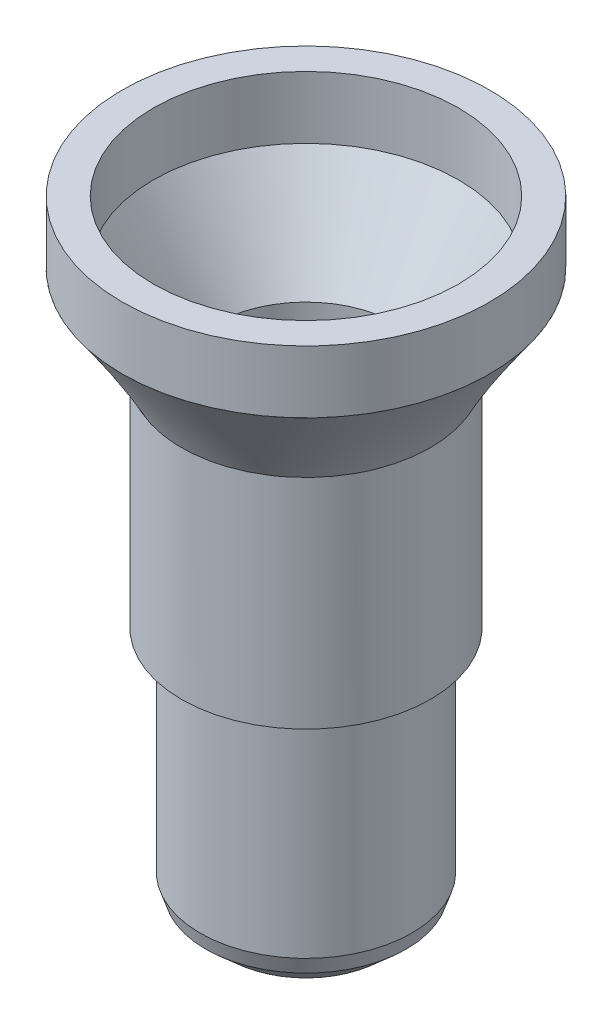
ISO-10303-21;
HEADER;
FILE_DESCRIPTION(('STEP AP214'),'2;1');
FILE_NAME('part.step','',(''),(''),'','','');
FILE_SCHEMA(('AUTOMOTIVE_DESIGN { 1 0 10303 214 1 1 1 1 }'));
ENDSEC;
DATA;
#1=APPLICATION_CONTEXT('core data for automotive mechanical design processes');
#2=APPLICATION_PROTOCOL_DEFINITION('international standard','automotive_design',2000,#1);
#3=PRODUCT_CONTEXT('',#1,'mechanical');
#4=PRODUCT('Part','Part','',(#3));
#5=PRODUCT_RELATED_PRODUCT_CATEGORY('part','',(#4));
#6=PRODUCT_DEFINITION_FORMATION('','',#4);
#7=PRODUCT_DEFINITION_CONTEXT('part definition',#1,'design');
#8=PRODUCT_DEFINITION('design','',#6,#7);
#9=PRODUCT_DEFINITION_SHAPE('','',#8);
#10=(LENGTH_UNIT() NAMED_UNIT(*) SI_UNIT(.MILLI.,.METRE.));
#11=(NAMED_UNIT(*) PLANE_ANGLE_UNIT() SI_UNIT($,.RADIAN.));
#12=(NAMED_UNIT(*) SI_UNIT($,.STERADIAN.) SOLID_ANGLE_UNIT());
#13=UNCERTAINTY_MEASURE_WITH_UNIT(LENGTH_MEASURE(1.E-05),#10,'distance_accuracy_value','');
#14=(GEOMETRIC_REPRESENTATION_CONTEXT(3) GLOBAL_UNCERTAINTY_ASSIGNED_CONTEXT((#13)) GLOBAL_UNIT_ASSIGNED_CONTEXT((#10,
#11,#12)) REPRESENTATION_CONTEXT('',''));
#15=CARTESIAN_POINT('',(0.,0.,0.));
#16=DIRECTION('',(0.,0.,1.));
#17=DIRECTION('',(1.,0.,0.));
#18=AXIS2_PLACEMENT_3D('',#15,#16,#17);
#19=CARTESIAN_POINT('',(21.38336763342,17.,0.));
#20=DIRECTION('',(0.,-1.,0.));
#21=DIRECTION('',(0.,0.,-1.));
#22=AXIS2_PLACEMENT_3D('',#19,#20,#21);
#23=CYLINDRICAL_SURFACE('',#22,4.9);
#24=CARTESIAN_POINT('',(21.38336763342,17.,0.));
#25=DIRECTION('',(0.,1.,0.));
#26=DIRECTION('',(0.,0.,1.));
#27=AXIS2_PLACEMENT_3D('',#24,#25,#26);
#28=CIRCLE('',#27,4.9);
#29=CARTESIAN_POINT('',(21.38336763342,17.,4.9));
#30=VERTEX_POINT('',#29);
#31=EDGE_CURVE('E71',#30,#30,#28,.T.);
#32=ORIENTED_EDGE('',*,*,#31,.T.);
#33=EDGE_LOOP('',(#32));
#34=FACE_BOUND('',#33,.T.);
#35=CARTESIAN_POINT('',(21.38336763342,15.,0.));
#36=DIRECTION('',(0.,1.,0.));
#37=DIRECTION('',(0.,0.,1.));
#38=AXIS2_PLACEMENT_3D('',#35,#36,#37);
#39=CIRCLE('',#38,4.9);
#40=CARTESIAN_POINT('',(21.38336763342,15.,4.9));
#41=VERTEX_POINT('',#40);
#42=EDGE_CURVE('E77',#41,#41,#39,.T.);
#43=ORIENTED_EDGE('',*,*,#42,.F.);
#44=EDGE_LOOP('',(#43));
#45=FACE_BOUND('',#44,.T.);
#46=ADVANCED_FACE('F64',(#34,#45),#23,.F.);
#47=CARTESIAN_POINT('',(21.38336763342,17.,0.));
#48=DIRECTION('',(0.,-1.,0.));
#49=DIRECTION('',(0.,0.,-1.));
#50=AXIS2_PLACEMENT_3D('',#47,#48,#49);
#51=CYLINDRICAL_SURFACE('',#50,5.9);
#52=CARTESIAN_POINT('',(21.38336763342,17.,0.));
#53=DIRECTION('',(0.,1.,0.));
#54=DIRECTION('',(0.,0.,1.));
#55=AXIS2_PLACEMENT_3D('',#52,#53,#54);
#56=CIRCLE('',#55,5.9);
#57=CARTESIAN_POINT('',(21.38336763342,17.,5.9));
#58=VERTEX_POINT('',#57);
#59=EDGE_CURVE('E12',#58,#58,#56,.T.);
#60=ORIENTED_EDGE('',*,*,#59,.F.);
#61=EDGE_LOOP('',(#60));
#62=FACE_BOUND('',#61,.T.);
#63=CARTESIAN_POINT('',(21.38336763342,15.,0.));
#64=DIRECTION('',(0.,1.,0.));
#65=DIRECTION('',(0.,0.,1.));
#66=AXIS2_PLACEMENT_3D('',#63,#64,#65);
#67=CIRCLE('',#66,5.9);
#68=CARTESIAN_POINT('',(21.38336763342,15.,5.9));
#69=VERTEX_POINT('',#68);
#70=EDGE_CURVE('E67',#69,#69,#67,.T.);
#71=ORIENTED_EDGE('',*,*,#70,.T.);
#72=EDGE_LOOP('',(#71));
#73=FACE_BOUND('',#72,.T.);
#74=ADVANCED_FACE('F84',(#62,#73),#51,.T.);
#75=CARTESIAN_POINT('',(0.,17.,0.));
#76=DIRECTION('',(0.,1.,0.));
#77=DIRECTION('',(0.,0.,1.));
#78=AXIS2_PLACEMENT_3D('',#75,#76,#77);
#79=PLANE('',#78);
#80=ORIENTED_EDGE('',*,*,#31,.F.);
#81=EDGE_LOOP('',(#80));
#82=FACE_BOUND('',#81,.T.);
#83=ORIENTED_EDGE('',*,*,#59,.T.);
#84=EDGE_LOOP('',(#83));
#85=FACE_BOUND('',#84,.T.);
#86=ADVANCED_FACE('F88',(#82,#85),#79,.T.);
#87=CARTESIAN_POINT('',(0.,15.,0.));
#88=DIRECTION('',(0.,1.,0.));
#89=DIRECTION('',(0.,0.,1.));
#90=AXIS2_PLACEMENT_3D('',#87,#88,#89);
#91=PLANE('',#90);
#92=ORIENTED_EDGE('',*,*,#42,.T.);
#93=EDGE_LOOP('',(#92));
#94=FACE_BOUND('',#93,.T.);
#95=ORIENTED_EDGE('',*,*,#70,.F.);
#96=EDGE_LOOP('',(#95));
#97=FACE_BOUND('',#96,.T.);
#98=ADVANCED_FACE('F86',(#94,#97),#91,.F.);
#99=CLOSED_SHELL('',(#46,#74,#86,#98));
#100=MANIFOLD_SOLID_BREP('B2',#99);
#101=CARTESIAN_POINT('',(21.38336763342,12.,0.));
#102=DIRECTION('',(0.,-1.,0.));
#103=DIRECTION('',(0.,0.,-1.));
#104=AXIS2_PLACEMENT_3D('',#101,#102,#103);
#105=CYLINDRICAL_SURFACE('',#104,4.);
#106=CARTESIAN_POINT('',(21.38336763342,5.,0.));
#107=DIRECTION('',(0.,1.,0.));
#108=DIRECTION('',(0.,0.,1.));
#109=AXIS2_PLACEMENT_3D('',#106,#107,#108);
#110=CIRCLE('',#109,4.);
#111=CARTESIAN_POINT('',(21.38336763342,5.,4.));
#112=VERTEX_POINT('',#111);
#113=EDGE_CURVE('E147',#112,#112,#110,.T.);
#114=ORIENTED_EDGE('',*,*,#113,.T.);
#115=EDGE_LOOP('',(#114));
#116=FACE_BOUND('',#115,.T.);
#117=CARTESIAN_POINT('',(21.38336763342,12.,0.));
#118=DIRECTION('',(0.,-1.,0.));
#119=DIRECTION('',(0.,0.,-1.));
#120=AXIS2_PLACEMENT_3D('',#117,#118,#119);
#121=CIRCLE('',#120,4.);
#122=CARTESIAN_POINT('',(18.3062228396149,12.,-2.555617326197));
#123=VERTEX_POINT('',#122);
#124=EDGE_CURVE('E136',#123,#123,#121,.F.);
#125=ORIENTED_EDGE('',*,*,#124,.F.);
#126=EDGE_LOOP('',(#125));
#127=FACE_BOUND('',#126,.T.);
#128=ADVANCED_FACE('F125',(#116,#127),#105,.T.);
#129=CARTESIAN_POINT('',(21.38336763342,15.,0.));
#130=DIRECTION('',(0.,1.,0.));
#131=DIRECTION('',(0.,0.,1.));
#132=AXIS2_PLACEMENT_3D('',#129,#130,#131);
#133=PLANE('',#132);
#134=CARTESIAN_POINT('',(21.38336763342,15.,0.));
#135=DIRECTION('',(0.,1.,0.));
#136=DIRECTION('',(0.,0.,1.));
#137=AXIS2_PLACEMENT_3D('',#134,#135,#136);
#138=CIRCLE('',#137,4.9);
#139=CARTESIAN_POINT('',(21.38336763342,15.,4.9));
#140=VERTEX_POINT('',#139);
#141=EDGE_CURVE('E146',#140,#140,#138,.T.);
#142=ORIENTED_EDGE('',*,*,#141,.F.);
#143=EDGE_LOOP('',(#142));
#144=FACE_BOUND('',#143,.T.);
#145=CARTESIAN_POINT('',(21.38336763342,15.,0.));
#146=DIRECTION('',(0.,1.,0.));
#147=DIRECTION('',(0.,0.,1.));
#148=AXIS2_PLACEMENT_3D('',#145,#146,#147);
#149=CIRCLE('',#148,5.9);
#150=CARTESIAN_POINT('',(18.411990743769,15.,-5.09714816143773));
#151=VERTEX_POINT('',#150);
#152=EDGE_CURVE('E140',#151,#151,#149,.T.);
#153=ORIENTED_EDGE('',*,*,#152,.T.);
#154=EDGE_LOOP('',(#153));
#155=FACE_BOUND('',#154,.T.);
#156=ADVANCED_FACE('F206',(#144,#155),#133,.T.);
#157=CARTESIAN_POINT('',(18.3062228396149,12.,-2.555617326197));
#158=CARTESIAN_POINT('',(18.411990743769,15.,-5.09714816143773));
#159=CARTESIAN_POINT('',(13.1949881872209,12.,3.59867226141316));
#160=CARTESIAN_POINT('',(8.21769442089354,15.,0.845605617864237));
#161=CARTESIAN_POINT('',(19.3492777748311,12.,8.70990691380715));
#162=CARTESIAN_POINT('',(14.1604482001955,15.,11.0399019407397));
#163=CARTESIAN_POINT('',(24.4605124272251,12.,2.555617326197));
#164=CARTESIAN_POINT('',(24.354744523071,15.,5.09714816143773));
#165=CARTESIAN_POINT('',(29.5717470796191,12.,-3.59867226141316));
#166=CARTESIAN_POINT('',(34.5490408459464,15.,-0.845605617864237));
#167=CARTESIAN_POINT('',(23.4174574920089,12.,-8.70990691380715));
#168=CARTESIAN_POINT('',(28.6062870666445,15.,-11.0399019407397));
#169=CARTESIAN_POINT('',(18.3062228396149,12.,-2.555617326197));
#170=CARTESIAN_POINT('',(18.411990743769,15.,-5.09714816143773));
#171=(BOUNDED_SURFACE() B_SPLINE_SURFACE(3,1,((#157,#158),(#159,#160),(#161,#162),(#163,#164),
(#165,#166),(#167,#168),(#169,#170)),.UNSPECIFIED.,.T.,.F.,.F.) B_SPLINE_SURFACE_WITH_KNOTS((4,
3,4),(2,2),(0.,0.5,1.),(0.,1.),
.UNSPECIFIED.) GEOMETRIC_REPRESENTATION_ITEM() RATIONAL_B_SPLINE_SURFACE(((1.,1.),
(0.333333333333333,0.333333333333333),(0.333333333333333,0.333333333333333),(1.,1.),
(0.333333333333333,0.333333333333333),(0.333333333333333,0.333333333333333),(1.,1.))) REPRESENTATION_ITEM('') SURFACE());
#172=CARTESIAN_POINT('',(18.3062228396149,12.,-2.555617326197));
#173=CARTESIAN_POINT('',(18.3073245886165,12.03125,-2.58209160573075));
#174=CARTESIAN_POINT('',(18.3084263376181,12.0625,-2.60856588526451));
#175=CARTESIAN_POINT('',(18.3106298356213,12.125,-2.66151444433203));
#176=CARTESIAN_POINT('',(18.3117315846229,12.15625,-2.68798872386578));
#177=CARTESIAN_POINT('',(18.3139350826261,12.21875,-2.7409372829333));
#178=CARTESIAN_POINT('',(18.3150368316278,12.25,-2.76741156246706));
#179=CARTESIAN_POINT('',(18.317240329631,12.3125,-2.82036012153457));
#180=CARTESIAN_POINT('',(18.3183420786326,12.34375,-2.84683440106833));
#181=CARTESIAN_POINT('',(18.3205455766358,12.40625,-2.89978296013585));
#182=CARTESIAN_POINT('',(18.3216473256374,12.4375,-2.9262572396696));
#183=CARTESIAN_POINT('',(18.3238508236406,12.5,-2.97920579873712));
#184=CARTESIAN_POINT('',(18.3249525726422,12.53125,-3.00568007827088));
#185=CARTESIAN_POINT('',(18.3271560706454,12.59375,-3.05862863733839));
#186=CARTESIAN_POINT('',(18.328257819647,12.625,-3.08510291687215));
#187=CARTESIAN_POINT('',(18.3304613176502,12.6875,-3.13805147593966));
#188=CARTESIAN_POINT('',(18.3315630666518,12.71875,-3.16452575547342));
#189=CARTESIAN_POINT('',(18.333766564655,12.78125,-3.21747431454094));
#190=CARTESIAN_POINT('',(18.3348683136566,12.8125,-3.2439485940747));
#191=CARTESIAN_POINT('',(18.3370718116599,12.875,-3.29689715314221));
#192=CARTESIAN_POINT('',(18.3381735606615,12.90625,-3.32337143267597));
#193=CARTESIAN_POINT('',(18.3403770586647,12.96875,-3.37631999174348));
#194=CARTESIAN_POINT('',(18.3414788076663,13.,-3.40279427127724));
#195=CARTESIAN_POINT('',(18.3436823056695,13.0625,-3.45574283034476));
#196=CARTESIAN_POINT('',(18.3447840546711,13.09375,-3.48221710987851));
#197=CARTESIAN_POINT('',(18.3469875526743,13.15625,-3.53516566894603));
#198=CARTESIAN_POINT('',(18.3480893016759,13.1875,-3.56163994847979));
#199=CARTESIAN_POINT('',(18.3502927996791,13.25,-3.6145885075473));
#200=CARTESIAN_POINT('',(18.3513945486807,13.28125,-3.64106278708106));
#201=CARTESIAN_POINT('',(18.3535980466839,13.34375,-3.69401134614858));
#202=CARTESIAN_POINT('',(18.3546997956855,13.375,-3.72048562568233));
#203=CARTESIAN_POINT('',(18.3569032936887,13.4375,-3.77343418474985));
#204=CARTESIAN_POINT('',(18.3580050426904,13.46875,-3.79990846428361));
#205=CARTESIAN_POINT('',(18.3602085406936,13.53125,-3.85285702335112));
#206=CARTESIAN_POINT('',(18.3613102896952,13.5625,-3.87933130288488));
#207=CARTESIAN_POINT('',(18.3635137876984,13.625,-3.9322798619524));
#208=CARTESIAN_POINT('',(18.3646155367,13.65625,-3.95875414148615));
#209=CARTESIAN_POINT('',(18.3668190347032,13.71875,-4.01170270055367));
#210=CARTESIAN_POINT('',(18.3679207837048,13.75,-4.03817698008743));
#211=CARTESIAN_POINT('',(18.370124281708,13.8125,-4.09112553915494));
#212=CARTESIAN_POINT('',(18.3712260307096,13.84375,-4.1175998186887));
#213=CARTESIAN_POINT('',(18.3734295287128,13.90625,-4.17054837775621));
#214=CARTESIAN_POINT('',(18.3745312777144,13.9375,-4.19702265728997));
#215=CARTESIAN_POINT('',(18.3767347757176,14.,-4.24997121635749));
#216=CARTESIAN_POINT('',(18.3778365247192,14.03125,-4.27644549589125));
#217=CARTESIAN_POINT('',(18.3800400227225,14.09375,-4.32939405495876));
#218=CARTESIAN_POINT('',(18.3811417717241,14.125,-4.35586833449252));
#219=CARTESIAN_POINT('',(18.3833452697273,14.1875,-4.40881689356003));
#220=CARTESIAN_POINT('',(18.3844470187289,14.21875,-4.43529117309379));
#221=CARTESIAN_POINT('',(18.3866505167321,14.28125,-4.48823973216131));
#222=CARTESIAN_POINT('',(18.3877522657337,14.3125,-4.51471401169506));
#223=CARTESIAN_POINT('',(18.3899557637369,14.375,-4.56766257076258));
#224=CARTESIAN_POINT('',(18.3910575127385,14.40625,-4.59413685029634));
#225=CARTESIAN_POINT('',(18.3932610107417,14.46875,-4.64708540936385));
#226=CARTESIAN_POINT('',(18.3943627597433,14.5,-4.67355968889761));
#227=CARTESIAN_POINT('',(18.3965662577465,14.5625,-4.72650824796513));
#228=CARTESIAN_POINT('',(18.3976680067481,14.59375,-4.75298252749888));
#229=CARTESIAN_POINT('',(18.3998715047513,14.65625,-4.8059310865664));
#230=CARTESIAN_POINT('',(18.400973253753,14.6875,-4.83240536610016));
#231=CARTESIAN_POINT('',(18.4031767517562,14.75,-4.88535392516767));
#232=CARTESIAN_POINT('',(18.4042785007578,14.78125,-4.91182820470143));
#233=CARTESIAN_POINT('',(18.406481998761,14.84375,-4.96477676376894));
#234=CARTESIAN_POINT('',(18.4075837477626,14.875,-4.9912510433027));
#235=CARTESIAN_POINT('',(18.4097872457658,14.9375,-5.04419960237022));
#236=CARTESIAN_POINT('',(18.4108889947674,14.96875,-5.07067388190398));
#237=CARTESIAN_POINT('',(18.411990743769,15.,-5.09714816143773));
#238=B_SPLINE_CURVE_WITH_KNOTS('',3,(#172,#173,#174,#175,#176,#177,#178,#179,#180,#181,#182,
#183,#184,#185,#186,#187,#188,#189,#190,#191,#192,#193,#194,#195,#196,#197,#198,#199,#200,#201,
#202,#203,#204,#205,#206,#207,#208,#209,#210,#211,#212,#213,#214,#215,#216,#217,#218,#219,#220,
#221,#222,#223,#224,#225,#226,#227,#228,#229,#230,#231,#232,#233,#234,#235,#236,#237),
.UNSPECIFIED.,.F.,.F.,(4,2,2,2,2,2,2,2,2,2,2,2,2,2,2,2,2,2,2,2,2,2,2,2,2,2,2,2,2,2,2,2,4),(0.,
0.12291450056542,0.245829001130841,0.368743501696261,0.491658002261682,0.614572502827102,
0.737487003392522,0.860401503957941,0.983316004523363,1.10623050508878,1.2291450056542,
1.35205950621962,1.47497400678504,1.59788850735046,1.72080300791588,1.8437175084813,
1.96663200904672,2.08954650961214,2.21246101017757,2.33537551074298,2.45829001130841,
2.58120451187383,2.70411901243925,2.82703351300467,2.94994801357009,3.07286251413551,
3.19577701470093,3.31869151526635,3.44160601583177,3.56452051639719,3.68743501696261,
3.81034951752803,3.93326401809345),.UNSPECIFIED.);
#239=EDGE_CURVE('BSEAM198',#123,#151,#238,.T.);
#240=ORIENTED_EDGE('',*,*,#124,.T.);
#241=ORIENTED_EDGE('',*,*,#152,.F.);
#242=ORIENTED_EDGE('',*,*,#239,.T.);
#243=ORIENTED_EDGE('',*,*,#239,.F.);
#244=EDGE_LOOP('',(#240,#242,#241,#243));
#245=FACE_BOUND('',#244,.T.);
#246=ADVANCED_FACE('F198',(#245),#171,.T.);
#247=CARTESIAN_POINT('',(21.38336763342,-3.,0.));
#248=DIRECTION('',(0.,-1.,0.));
#249=DIRECTION('',(0.,0.,-1.));
#250=AXIS2_PLACEMENT_3D('',#247,#248,#249);
#251=PLANE('',#250);
#252=CARTESIAN_POINT('',(21.38336763342,-3.,0.));
#253=DIRECTION('',(0.,-1.,0.));
#254=DIRECTION('',(0.,0.,-1.));
#255=AXIS2_PLACEMENT_3D('',#252,#253,#254);
#256=CIRCLE('',#255,2.47247045885669);
#257=CARTESIAN_POINT('',(21.38336763342,-3.,-2.47247045885669));
#258=VERTEX_POINT('',#257);
#259=EDGE_CURVE('E132',#258,#258,#256,.T.);
#260=ORIENTED_EDGE('',*,*,#259,.T.);
#261=EDGE_LOOP('',(#260));
#262=FACE_BOUND('',#261,.T.);
#263=CARTESIAN_POINT('',(21.38336763342,-3.,0.));
#264=DIRECTION('',(0.,-1.,0.));
#265=DIRECTION('',(0.,0.,-1.));
#266=AXIS2_PLACEMENT_3D('',#263,#264,#265);
#267=CIRCLE('',#266,2.);
#268=CARTESIAN_POINT('',(23.3292747553473,-3.,-0.462001593971954));
#269=VERTEX_POINT('',#268);
#270=EDGE_CURVE('E152',#269,#269,#267,.T.);
#271=ORIENTED_EDGE('',*,*,#270,.F.);
#272=EDGE_LOOP('',(#271));
#273=FACE_BOUND('',#272,.T.);
#274=ADVANCED_FACE('F190',(#262,#273),#251,.T.);
#275=CARTESIAN_POINT('',(21.38336763342,-3.,0.));
#276=DIRECTION('',(0.,1.,0.));
#277=DIRECTION('',(0.,0.,1.));
#278=AXIS2_PLACEMENT_3D('',#275,#276,#277);
#279=CONICAL_SURFACE('',#278,3.,0.321750554396642);
#280=CARTESIAN_POINT('',(21.38336763342,-2.33592169136464,0.));
#281=DIRECTION('',(0.,-1.,0.));
#282=DIRECTION('',(0.,0.,-1.));
#283=AXIS2_PLACEMENT_3D('',#280,#281,#282);
#284=CIRCLE('',#283,3.22135943621179);
#285=CARTESIAN_POINT('',(21.38336763342,-2.33592169136464,-3.22135943621179));
#286=VERTEX_POINT('',#285);
#287=EDGE_CURVE('E63',#286,#286,#284,.F.);
#288=ORIENTED_EDGE('',*,*,#287,.T.);
#289=EDGE_LOOP('',(#288));
#290=FACE_BOUND('',#289,.T.);
#291=CARTESIAN_POINT('',(21.38336763342,-1.8,0.));
#292=DIRECTION('',(0.,1.,0.));
#293=DIRECTION('',(0.,0.,1.));
#294=AXIS2_PLACEMENT_3D('',#291,#292,#293);
#295=CIRCLE('',#294,3.4);
#296=CARTESIAN_POINT('',(21.38336763342,-1.8,3.4));
#297=VERTEX_POINT('',#296);
#298=EDGE_CURVE('E143',#297,#297,#295,.T.);
#299=ORIENTED_EDGE('',*,*,#298,.F.);
#300=EDGE_LOOP('',(#299));
#301=FACE_BOUND('',#300,.T.);
#302=ADVANCED_FACE('F185',(#290,#301),#279,.T.);
#303=CARTESIAN_POINT('',(23.3292747553473,-3.,-0.462001593971954));
#304=CARTESIAN_POINT('',(22.5667866793311,0.,-2.64754969014273));
#305=CARTESIAN_POINT('',(22.4052715674034,-3.,-4.35381583782655));
#306=CARTESIAN_POINT('',(17.2716872990456,0.,-5.01438778196493));
#307=CARTESIAN_POINT('',(18.5134573235488,-3.,-3.42981264988264));
#308=CARTESIAN_POINT('',(14.9048492072234,0.,0.280711598320518));
#309=CARTESIAN_POINT('',(19.4374605114927,-3.,0.462001593971954));
#310=CARTESIAN_POINT('',(20.1999485875089,0.,2.64754969014273));
#311=CARTESIAN_POINT('',(20.3614636994366,-3.,4.35381583782655));
#312=CARTESIAN_POINT('',(25.4950479677943,0.,5.01438778196494));
#313=CARTESIAN_POINT('',(24.2532779432912,-3.,3.42981264988264));
#314=CARTESIAN_POINT('',(27.8618860596166,0.,-0.280711598320516));
#315=CARTESIAN_POINT('',(23.3292747553473,-3.,-0.462001593971954));
#316=CARTESIAN_POINT('',(22.5667866793311,0.,-2.64754969014273));
#317=(BOUNDED_SURFACE() B_SPLINE_SURFACE(3,1,((#303,#304),(#305,#306),(#307,#308),(#309,#310),
(#311,#312),(#313,#314),(#315,#316)),.UNSPECIFIED.,.T.,.F.,.F.) B_SPLINE_SURFACE_WITH_KNOTS((4,
3,4),(2,2),(0.,0.5,1.),(0.,1.),
.UNSPECIFIED.) GEOMETRIC_REPRESENTATION_ITEM() RATIONAL_B_SPLINE_SURFACE(((1.,1.),
(0.333333333333333,0.333333333333334),(0.333333333333333,0.333333333333334),(1.,1.),
(0.333333333333333,0.333333333333333),(0.333333333333333,0.333333333333333),(1.,1.))) REPRESENTATION_ITEM('') SURFACE());
#318=CARTESIAN_POINT('',(21.38336763342,0.,0.));
#319=DIRECTION('',(0.,1.,0.));
#320=DIRECTION('',(0.,0.,1.));
#321=AXIS2_PLACEMENT_3D('',#318,#319,#320);
#322=CIRCLE('',#321,2.9);
#323=CARTESIAN_POINT('',(22.5667866793311,0.,-2.64754969014273));
#324=VERTEX_POINT('',#323);
#325=EDGE_CURVE('E166',#324,#324,#322,.T.);
#326=CARTESIAN_POINT('',(23.3292747553473,-3.,-0.462001593971954));
#327=CARTESIAN_POINT('',(23.3213321712221,-2.96875,-0.484767719973733));
#328=CARTESIAN_POINT('',(23.3133895870969,-2.9375,-0.507533845975512));
#329=CARTESIAN_POINT('',(23.2975044188466,-2.875,-0.553066097979069));
#330=CARTESIAN_POINT('',(23.2895618347214,-2.84375,-0.575832223980848));
#331=CARTESIAN_POINT('',(23.2736766664711,-2.78125,-0.621364475984406));
#332=CARTESIAN_POINT('',(23.2657340823459,-2.75,-0.644130601986185));
#333=CARTESIAN_POINT('',(23.2498489140956,-2.6875,-0.689662853989743));
#334=CARTESIAN_POINT('',(23.2419063299704,-2.65625,-0.712428979991522));
#335=CARTESIAN_POINT('',(23.2260211617201,-2.59375,-0.75796123199508));
#336=CARTESIAN_POINT('',(23.2180785775949,-2.5625,-0.780727357996858));
#337=CARTESIAN_POINT('',(23.2021934093446,-2.5,-0.826259610000416));
#338=CARTESIAN_POINT('',(23.1942508252194,-2.46875,-0.849025736002195));
#339=CARTESIAN_POINT('',(23.1783656569691,-2.40625,-0.894557988005753));
#340=CARTESIAN_POINT('',(23.1704230728439,-2.375,-0.917324114007532));
#341=CARTESIAN_POINT('',(23.1545379045936,-2.3125,-0.962856366011089));
#342=CARTESIAN_POINT('',(23.1465953204684,-2.28125,-0.985622492012868));
#343=CARTESIAN_POINT('',(23.1307101522181,-2.21875,-1.03115474401643));
#344=CARTESIAN_POINT('',(23.1227675680929,-2.1875,-1.05392087001821));
#345=CARTESIAN_POINT('',(23.1068823998426,-2.125,-1.09945312202176));
#346=CARTESIAN_POINT('',(23.0989398157174,-2.09375,-1.12221924802354));
#347=CARTESIAN_POINT('',(23.0830546474671,-2.03125,-1.1677515000271));
#348=CARTESIAN_POINT('',(23.0751120633419,-2.,-1.19051762602888));
#349=CARTESIAN_POINT('',(23.0592268950916,-1.9375,-1.23604987803244));
#350=CARTESIAN_POINT('',(23.0512843109664,-1.90625,-1.25881600403422));
#351=CARTESIAN_POINT('',(23.035399142716,-1.84375,-1.30434825603777));
#352=CARTESIAN_POINT('',(23.0274565585909,-1.8125,-1.32711438203955));
#353=CARTESIAN_POINT('',(23.0115713903405,-1.75,-1.37264663404311));
#354=CARTESIAN_POINT('',(23.0036288062154,-1.71875,-1.39541276004489));
#355=CARTESIAN_POINT('',(22.987743637965,-1.65625,-1.44094501204845));
#356=CARTESIAN_POINT('',(22.9798010538399,-1.625,-1.46371113805023));
#357=CARTESIAN_POINT('',(22.9639158855895,-1.5625,-1.50924339005378));
#358=CARTESIAN_POINT('',(22.9559733014644,-1.53125,-1.53200951605556));
#359=CARTESIAN_POINT('',(22.940088133214,-1.46875,-1.57754176805912));
#360=CARTESIAN_POINT('',(22.9321455490889,-1.4375,-1.6003078940609));
#361=CARTESIAN_POINT('',(22.9162603808385,-1.375,-1.64584014606446));
#362=CARTESIAN_POINT('',(22.9083177967133,-1.34375,-1.66860627206624));
#363=CARTESIAN_POINT('',(22.892432628463,-1.28125,-1.71413852406979));
#364=CARTESIAN_POINT('',(22.8844900443378,-1.25,-1.73690465007157));
#365=CARTESIAN_POINT('',(22.8686048760875,-1.1875,-1.78243690207513));
#366=CARTESIAN_POINT('',(22.8606622919623,-1.15625,-1.80520302807691));
#367=CARTESIAN_POINT('',(22.844777123712,-1.09375,-1.85073528008047));
#368=CARTESIAN_POINT('',(22.8368345395868,-1.0625,-1.87350140608225));
#369=CARTESIAN_POINT('',(22.8209493713365,-1.,-1.9190336580858));
#370=CARTESIAN_POINT('',(22.8130067872113,-0.96875,-1.94179978408758));
#371=CARTESIAN_POINT('',(22.797121618961,-0.90625,-1.98733203609114));
#372=CARTESIAN_POINT('',(22.7891790348358,-0.875,-2.01009816209292));
#373=CARTESIAN_POINT('',(22.7732938665855,-0.8125,-2.05563041409648));
#374=CARTESIAN_POINT('',(22.7653512824603,-0.78125,-2.07839654009826));
#375=CARTESIAN_POINT('',(22.74946611421,-0.71875,-2.12392879210181));
#376=CARTESIAN_POINT('',(22.7415235300848,-0.6875,-2.14669491810359));
#377=CARTESIAN_POINT('',(22.7256383618345,-0.625,-2.19222717010715));
#378=CARTESIAN_POINT('',(22.7176957777093,-0.59375,-2.21499329610893));
#379=CARTESIAN_POINT('',(22.701810609459,-0.53125,-2.26052554811249));
#380=CARTESIAN_POINT('',(22.6938680253338,-0.5,-2.28329167411427));
#381=CARTESIAN_POINT('',(22.6779828570835,-0.4375,-2.32882392611782));
#382=CARTESIAN_POINT('',(22.6700402729583,-0.40625,-2.3515900521196));
#383=CARTESIAN_POINT('',(22.654155104708,-0.34375,-2.39712230412316));
#384=CARTESIAN_POINT('',(22.6462125205828,-0.3125,-2.41988843012494));
#385=CARTESIAN_POINT('',(22.6303273523324,-0.25,-2.4654206821285));
#386=CARTESIAN_POINT('',(22.6223847682073,-0.21875,-2.48818680813028));
#387=CARTESIAN_POINT('',(22.6064995999569,-0.15625,-2.53371906013383));
#388=CARTESIAN_POINT('',(22.5985570158318,-0.125,-2.55648518613561));
#389=CARTESIAN_POINT('',(22.5826718475814,-0.0625,-2.60201743813917));
#390=CARTESIAN_POINT('',(22.5747292634563,-0.03125,-2.62478356414095));
#391=CARTESIAN_POINT('',(22.5667866793311,0.,-2.64754969014273));
#392=B_SPLINE_CURVE_WITH_KNOTS('',3,(#326,#327,#328,#329,#330,#331,#332,#333,#334,#335,#336,
#337,#338,#339,#340,#341,#342,#343,#344,#345,#346,#347,#348,#349,#350,#351,#352,#353,#354,#355,
#356,#357,#358,#359,#360,#361,#362,#363,#364,#365,#366,#367,#368,#369,#370,#371,#372,#373,#374,
#375,#376,#377,#378,#379,#380,#381,#382,#383,#384,#385,#386,#387,#388,#389,#390,#391),
.UNSPECIFIED.,.F.,.F.,(4,2,2,2,2,2,2,2,2,2,2,2,2,2,2,2,2,2,2,2,2,2,2,2,2,2,2,2,2,2,2,2,4),(0.,
0.118412384155663,0.236824768311326,0.355237152466989,0.473649536622652,0.592061920778315,
0.710474304933978,0.828886689089641,0.947299073245303,1.06571145740097,1.18412384155663,
1.30253622571229,1.42094860986796,1.53936099402362,1.65777337817928,1.77618576233494,
1.89459814649061,2.01301053064627,2.13142291480193,2.2498352989576,2.36824768311326,
2.48666006726892,2.60507245142459,2.72348483558025,2.84189721973591,2.96030960389157,
3.07872198804724,3.1971343722029,3.31554675635856,3.43395914051423,3.55237152466989,
3.67078390882555,3.78919629298121),.UNSPECIFIED.);
#393=EDGE_CURVE('BSEAM172',#269,#324,#392,.T.);
#394=ORIENTED_EDGE('',*,*,#270,.T.);
#395=ORIENTED_EDGE('',*,*,#325,.T.);
#396=ORIENTED_EDGE('',*,*,#393,.T.);
#397=ORIENTED_EDGE('',*,*,#393,.F.);
#398=EDGE_LOOP('',(#394,#396,#395,#397));
#399=FACE_BOUND('',#398,.T.);
#400=ADVANCED_FACE('F172',(#399),#317,.F.);
#401=CARTESIAN_POINT('',(21.38336763342,12.,0.));
#402=DIRECTION('',(0.,-1.,0.));
#403=DIRECTION('',(0.,0.,-1.));
#404=AXIS2_PLACEMENT_3D('',#401,#402,#403);
#405=CYLINDRICAL_SURFACE('',#404,2.9);
#406=CARTESIAN_POINT('',(21.38336763342,12.,0.));
#407=DIRECTION('',(0.,1.,0.));
#408=DIRECTION('',(0.,0.,1.));
#409=AXIS2_PLACEMENT_3D('',#406,#407,#408);
#410=CIRCLE('',#409,2.9);
#411=CARTESIAN_POINT('',(21.38336763342,12.,2.9));
#412=VERTEX_POINT('',#411);
#413=EDGE_CURVE('E148',#412,#412,#410,.T.);
#414=ORIENTED_EDGE('',*,*,#413,.T.);
#415=EDGE_LOOP('',(#414));
#416=FACE_BOUND('',#415,.T.);
#417=ORIENTED_EDGE('',*,*,#325,.F.);
#418=EDGE_LOOP('',(#417));
#419=FACE_BOUND('',#418,.T.);
#420=ADVANCED_FACE('F184',(#416,#419),#405,.F.);
#421=CARTESIAN_POINT('',(21.38336763342,12.,0.));
#422=DIRECTION('',(0.,1.,0.));
#423=DIRECTION('',(0.,0.,1.));
#424=AXIS2_PLACEMENT_3D('',#421,#422,#423);
#425=CONICAL_SURFACE('',#424,2.9,0.588002603547568);
#426=ORIENTED_EDGE('',*,*,#141,.T.);
#427=EDGE_LOOP('',(#426));
#428=FACE_BOUND('',#427,.T.);
#429=ORIENTED_EDGE('',*,*,#413,.F.);
#430=EDGE_LOOP('',(#429));
#431=FACE_BOUND('',#430,.T.);
#432=ADVANCED_FACE('F187',(#428,#431),#425,.F.);
#433=CARTESIAN_POINT('',(21.38336763342,5.,0.));
#434=DIRECTION('',(0.,1.,0.));
#435=DIRECTION('',(0.,0.,1.));
#436=AXIS2_PLACEMENT_3D('',#433,#434,#435);
#437=PLANE('',#436);
#438=ORIENTED_EDGE('',*,*,#113,.F.);
#439=EDGE_LOOP('',(#438));
#440=FACE_BOUND('',#439,.T.);
#441=CARTESIAN_POINT('',(21.38336763342,5.,0.));
#442=DIRECTION('',(0.,1.,0.));
#443=DIRECTION('',(0.,0.,1.));
#444=AXIS2_PLACEMENT_3D('',#441,#442,#443);
#445=CIRCLE('',#444,3.4);
#446=CARTESIAN_POINT('',(21.38336763342,5.,3.4));
#447=VERTEX_POINT('',#446);
#448=EDGE_CURVE('E268',#447,#447,#445,.T.);
#449=ORIENTED_EDGE('',*,*,#448,.T.);
#450=EDGE_LOOP('',(#449));
#451=FACE_BOUND('',#450,.T.);
#452=ADVANCED_FACE('F304',(#440,#451),#437,.F.);
#453=CARTESIAN_POINT('',(21.38336763342,5.,0.));
#454=DIRECTION('',(0.,-1.,0.));
#455=DIRECTION('',(0.,0.,-1.));
#456=AXIS2_PLACEMENT_3D('',#453,#454,#455);
#457=CYLINDRICAL_SURFACE('',#456,3.4);
#458=ORIENTED_EDGE('',*,*,#298,.T.);
#459=EDGE_LOOP('',(#458));
#460=FACE_BOUND('',#459,.T.);
#461=ORIENTED_EDGE('',*,*,#448,.F.);
#462=EDGE_LOOP('',(#461));
#463=FACE_BOUND('',#462,.T.);
#464=ADVANCED_FACE('F308',(#460,#463),#457,.T.);
#465=CARTESIAN_POINT('',(21.38336763342,-3.,0.));
#466=DIRECTION('',(0.,1.,0.));
#467=DIRECTION('',(0.,0.,1.));
#468=AXIS2_PLACEMENT_3D('',#465,#466,#467);
#469=CONICAL_SURFACE('',#468,2.47247045885669,0.845349329994937);
#470=ORIENTED_EDGE('',*,*,#287,.F.);
#471=EDGE_LOOP('',(#470));
#472=FACE_BOUND('',#471,.T.);
#473=ORIENTED_EDGE('',*,*,#259,.F.);
#474=EDGE_LOOP('',(#473));
#475=FACE_BOUND('',#474,.T.);
#476=ADVANCED_FACE('F127',(#472,#475),#469,.T.);
#477=CLOSED_SHELL('',(#128,#156,#246,#274,#302,#400,#420,#432,#452,#464,#476));
#478=MANIFOLD_SOLID_BREP('B7',#477);
#479=ADVANCED_BREP_SHAPE_REPRESENTATION('',(#18,#100,#478),#14);
#480=SHAPE_DEFINITION_REPRESENTATION(#9,#479);
ENDSEC;
END-ISO-10303-21;
